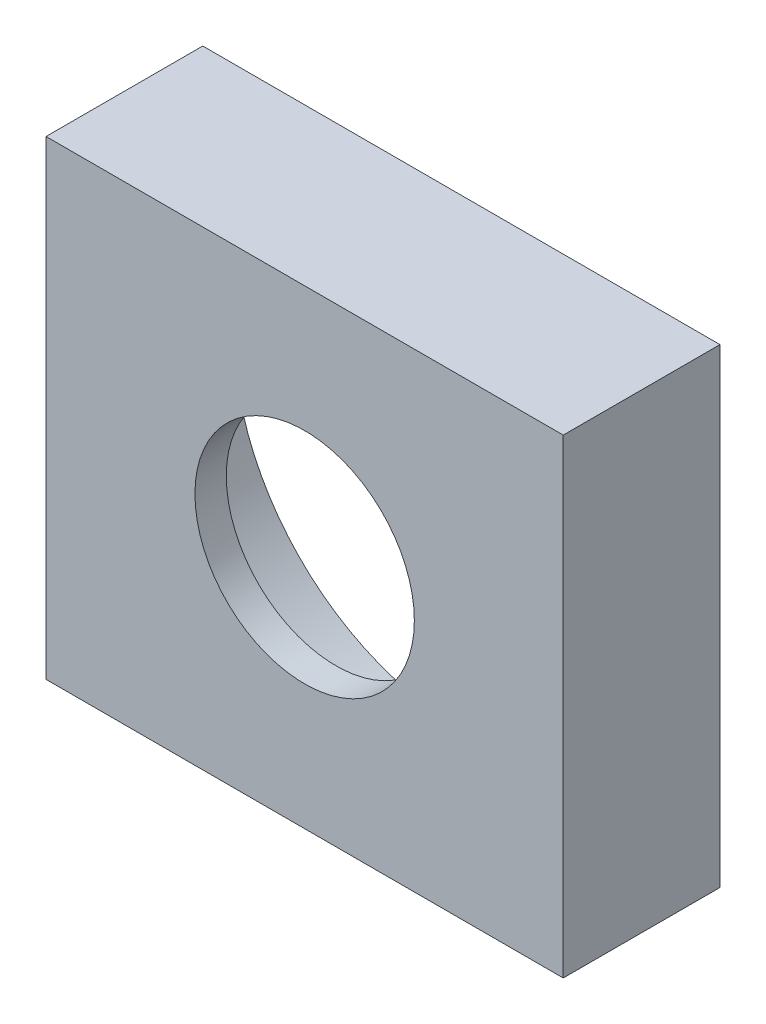
ISO-10303-21;
HEADER;
FILE_DESCRIPTION(('STEP AP214'),'2;1');
FILE_NAME('part.step','',(''),(''),'','','');
FILE_SCHEMA(('AUTOMOTIVE_DESIGN { 1 0 10303 214 1 1 1 1 }'));
ENDSEC;
DATA;
#1=APPLICATION_CONTEXT('core data for automotive mechanical design processes');
#2=APPLICATION_PROTOCOL_DEFINITION('international standard','automotive_design',2000,#1);
#3=PRODUCT_CONTEXT('',#1,'mechanical');
#4=PRODUCT('Part','Part','',(#3));
#5=PRODUCT_RELATED_PRODUCT_CATEGORY('part','',(#4));
#6=PRODUCT_DEFINITION_FORMATION('','',#4);
#7=PRODUCT_DEFINITION_CONTEXT('part definition',#1,'design');
#8=PRODUCT_DEFINITION('design','',#6,#7);
#9=PRODUCT_DEFINITION_SHAPE('','',#8);
#10=(LENGTH_UNIT() NAMED_UNIT(*) SI_UNIT(.MILLI.,.METRE.));
#11=(NAMED_UNIT(*) PLANE_ANGLE_UNIT() SI_UNIT($,.RADIAN.));
#12=(NAMED_UNIT(*) SI_UNIT($,.STERADIAN.) SOLID_ANGLE_UNIT());
#13=UNCERTAINTY_MEASURE_WITH_UNIT(LENGTH_MEASURE(1.E-05),#10,'distance_accuracy_value','');
#14=(GEOMETRIC_REPRESENTATION_CONTEXT(3) GLOBAL_UNCERTAINTY_ASSIGNED_CONTEXT((#13)) GLOBAL_UNIT_ASSIGNED_CONTEXT((#10,
#11,#12)) REPRESENTATION_CONTEXT('',''));
#15=CARTESIAN_POINT('',(0.,0.,0.));
#16=DIRECTION('',(0.,0.,1.));
#17=DIRECTION('',(1.,0.,0.));
#18=AXIS2_PLACEMENT_3D('',#15,#16,#17);
#19=CARTESIAN_POINT('',(16.5,15.,-0.000999999999999265));
#20=DIRECTION('',(0.,0.,1.));
#21=DIRECTION('',(1.,0.,0.));
#22=AXIS2_PLACEMENT_3D('',#19,#20,#21);
#23=CYLINDRICAL_SURFACE('',#22,7.);
#24=CARTESIAN_POINT('',(16.5,15.,10.));
#25=DIRECTION('',(0.,0.,1.));
#26=DIRECTION('',(1.,0.,0.));
#27=AXIS2_PLACEMENT_3D('',#24,#25,#26);
#28=CIRCLE('',#27,7.);
#29=CARTESIAN_POINT('',(23.5,15.,10.));
#30=VERTEX_POINT('',#29);
#31=EDGE_CURVE('E187',#30,#30,#28,.T.);
#32=ORIENTED_EDGE('',*,*,#31,.T.);
#33=EDGE_LOOP('',(#32));
#34=FACE_BOUND('',#33,.T.);
#35=CARTESIAN_POINT('',(16.5,15.,8.));
#36=DIRECTION('',(0.,0.,-1.));
#37=DIRECTION('',(-1.,0.,0.));
#38=AXIS2_PLACEMENT_3D('',#35,#36,#37);
#39=CIRCLE('',#38,7.);
#40=CARTESIAN_POINT('',(9.5,15.,8.));
#41=VERTEX_POINT('',#40);
#42=EDGE_CURVE('E184',#41,#41,#39,.F.);
#43=ORIENTED_EDGE('',*,*,#42,.F.);
#44=EDGE_LOOP('',(#43));
#45=FACE_BOUND('',#44,.T.);
#46=ADVANCED_FACE('F35',(#34,#45),#23,.F.);
#47=CARTESIAN_POINT('',(0.,0.,10.));
#48=DIRECTION('',(1.,0.,0.));
#49=DIRECTION('',(0.,0.,-1.));
#50=AXIS2_PLACEMENT_3D('',#47,#48,#49);
#51=PLANE('',#50);
#52=DIRECTION('',(0.,-1.,0.));
#53=VECTOR('',#52,1.);
#54=CARTESIAN_POINT('',(0.,0.,0.));
#55=LINE('',#54,#53);
#56=CARTESIAN_POINT('',(0.,30.,0.));
#57=VERTEX_POINT('',#56);
#58=CARTESIAN_POINT('',(0.,0.,0.));
#59=VERTEX_POINT('',#58);
#60=EDGE_CURVE('E163',#57,#59,#55,.T.);
#61=ORIENTED_EDGE('',*,*,#60,.T.);
#62=DIRECTION('',(0.,0.,-1.));
#63=VECTOR('',#62,1.);
#64=CARTESIAN_POINT('',(0.,0.,10.));
#65=LINE('',#64,#63);
#66=CARTESIAN_POINT('',(0.,0.,10.));
#67=VERTEX_POINT('',#66);
#68=EDGE_CURVE('E157',#67,#59,#65,.T.);
#69=ORIENTED_EDGE('',*,*,#68,.F.);
#70=DIRECTION('',(0.,-1.,0.));
#71=VECTOR('',#70,1.);
#72=CARTESIAN_POINT('',(0.,0.,10.));
#73=LINE('',#72,#71);
#74=CARTESIAN_POINT('',(0.,30.,10.));
#75=VERTEX_POINT('',#74);
#76=EDGE_CURVE('E173',#75,#67,#73,.T.);
#77=ORIENTED_EDGE('',*,*,#76,.F.);
#78=DIRECTION('',(0.,0.,-1.));
#79=VECTOR('',#78,1.);
#80=CARTESIAN_POINT('',(0.,30.,10.));
#81=LINE('',#80,#79);
#82=EDGE_CURVE('E177',#75,#57,#81,.T.);
#83=ORIENTED_EDGE('',*,*,#82,.T.);
#84=EDGE_LOOP('',(#61,#69,#77,#83));
#85=FACE_BOUND('',#84,.T.);
#86=ADVANCED_FACE('F37',(#85),#51,.F.);
#87=CARTESIAN_POINT('',(0.,0.,10.));
#88=DIRECTION('',(0.,1.,0.));
#89=DIRECTION('',(0.,0.,1.));
#90=AXIS2_PLACEMENT_3D('',#87,#88,#89);
#91=PLANE('',#90);
#92=CARTESIAN_POINT('',(3.,0.,6.));
#93=DIRECTION('',(0.,-1.,0.));
#94=DIRECTION('',(0.,0.,-1.));
#95=AXIS2_PLACEMENT_3D('',#92,#93,#94);
#96=CIRCLE('',#95,1.25);
#97=CARTESIAN_POINT('',(3.,0.,4.75));
#98=VERTEX_POINT('',#97);
#99=EDGE_CURVE('E145',#98,#98,#96,.T.);
#100=ORIENTED_EDGE('',*,*,#99,.F.);
#101=EDGE_LOOP('',(#100));
#102=FACE_BOUND('',#101,.T.);
#103=CARTESIAN_POINT('',(30.,0.,6.));
#104=DIRECTION('',(0.,-1.,0.));
#105=DIRECTION('',(0.,0.,-1.));
#106=AXIS2_PLACEMENT_3D('',#103,#104,#105);
#107=CIRCLE('',#106,1.25);
#108=CARTESIAN_POINT('',(30.,0.,4.75));
#109=VERTEX_POINT('',#108);
#110=EDGE_CURVE('E149',#109,#109,#107,.T.);
#111=ORIENTED_EDGE('',*,*,#110,.F.);
#112=EDGE_LOOP('',(#111));
#113=FACE_BOUND('',#112,.T.);
#114=DIRECTION('',(1.,0.,0.));
#115=VECTOR('',#114,1.);
#116=CARTESIAN_POINT('',(0.,0.,0.));
#117=LINE('',#116,#115);
#118=CARTESIAN_POINT('',(33.,0.,0.));
#119=VERTEX_POINT('',#118);
#120=EDGE_CURVE('E152',#59,#119,#117,.T.);
#121=ORIENTED_EDGE('',*,*,#120,.T.);
#122=DIRECTION('',(0.,0.,-1.));
#123=VECTOR('',#122,1.);
#124=CARTESIAN_POINT('',(33.,0.,10.));
#125=LINE('',#124,#123);
#126=CARTESIAN_POINT('',(33.,0.,10.));
#127=VERTEX_POINT('',#126);
#128=EDGE_CURVE('E154',#127,#119,#125,.T.);
#129=ORIENTED_EDGE('',*,*,#128,.F.);
#130=DIRECTION('',(1.,0.,0.));
#131=VECTOR('',#130,1.);
#132=CARTESIAN_POINT('',(0.,0.,10.));
#133=LINE('',#132,#131);
#134=EDGE_CURVE('E226',#67,#127,#133,.T.);
#135=ORIENTED_EDGE('',*,*,#134,.F.);
#136=ORIENTED_EDGE('',*,*,#68,.T.);
#137=EDGE_LOOP('',(#121,#129,#135,#136));
#138=FACE_BOUND('',#137,.T.);
#139=ADVANCED_FACE('F114',(#102,#113,#138),#91,.F.);
#140=CARTESIAN_POINT('',(33.,0.,10.));
#141=DIRECTION('',(-1.,0.,0.));
#142=DIRECTION('',(0.,0.,1.));
#143=AXIS2_PLACEMENT_3D('',#140,#141,#142);
#144=PLANE('',#143);
#145=DIRECTION('',(0.,1.,0.));
#146=VECTOR('',#145,1.);
#147=CARTESIAN_POINT('',(33.,0.,0.));
#148=LINE('',#147,#146);
#149=CARTESIAN_POINT('',(33.,30.,0.));
#150=VERTEX_POINT('',#149);
#151=EDGE_CURVE('E162',#119,#150,#148,.T.);
#152=ORIENTED_EDGE('',*,*,#151,.T.);
#153=DIRECTION('',(0.,0.,-1.));
#154=VECTOR('',#153,1.);
#155=CARTESIAN_POINT('',(33.,30.,10.));
#156=LINE('',#155,#154);
#157=CARTESIAN_POINT('',(33.,30.,10.));
#158=VERTEX_POINT('',#157);
#159=EDGE_CURVE('E168',#158,#150,#156,.T.);
#160=ORIENTED_EDGE('',*,*,#159,.F.);
#161=DIRECTION('',(0.,1.,0.));
#162=VECTOR('',#161,1.);
#163=CARTESIAN_POINT('',(33.,0.,10.));
#164=LINE('',#163,#162);
#165=EDGE_CURVE('E167',#127,#158,#164,.T.);
#166=ORIENTED_EDGE('',*,*,#165,.F.);
#167=ORIENTED_EDGE('',*,*,#128,.T.);
#168=EDGE_LOOP('',(#152,#160,#166,#167));
#169=FACE_BOUND('',#168,.T.);
#170=ADVANCED_FACE('F134',(#169),#144,.F.);
#171=CARTESIAN_POINT('',(0.,30.,10.));
#172=DIRECTION('',(0.,-1.,0.));
#173=DIRECTION('',(0.,0.,-1.));
#174=AXIS2_PLACEMENT_3D('',#171,#172,#173);
#175=PLANE('',#174);
#176=DIRECTION('',(-1.,0.,0.));
#177=VECTOR('',#176,1.);
#178=CARTESIAN_POINT('',(0.,30.,0.));
#179=LINE('',#178,#177);
#180=EDGE_CURVE('E171',#150,#57,#179,.T.);
#181=ORIENTED_EDGE('',*,*,#180,.T.);
#182=ORIENTED_EDGE('',*,*,#82,.F.);
#183=DIRECTION('',(-1.,0.,0.));
#184=VECTOR('',#183,1.);
#185=CARTESIAN_POINT('',(0.,30.,10.));
#186=LINE('',#185,#184);
#187=EDGE_CURVE('E180',#158,#75,#186,.T.);
#188=ORIENTED_EDGE('',*,*,#187,.F.);
#189=ORIENTED_EDGE('',*,*,#159,.T.);
#190=EDGE_LOOP('',(#181,#182,#188,#189));
#191=FACE_BOUND('',#190,.T.);
#192=ADVANCED_FACE('F126',(#191),#175,.F.);
#193=CARTESIAN_POINT('',(0.,30.,10.));
#194=DIRECTION('',(0.,0.,-1.));
#195=DIRECTION('',(-1.,0.,0.));
#196=AXIS2_PLACEMENT_3D('',#193,#194,#195);
#197=PLANE('',#196);
#198=ORIENTED_EDGE('',*,*,#31,.F.);
#199=EDGE_LOOP('',(#198));
#200=FACE_BOUND('',#199,.T.);
#201=ORIENTED_EDGE('',*,*,#76,.T.);
#202=ORIENTED_EDGE('',*,*,#134,.T.);
#203=ORIENTED_EDGE('',*,*,#165,.T.);
#204=ORIENTED_EDGE('',*,*,#187,.T.);
#205=EDGE_LOOP('',(#201,#202,#203,#204));
#206=FACE_BOUND('',#205,.T.);
#207=ADVANCED_FACE('F122',(#200,#206),#197,.F.);
#208=CARTESIAN_POINT('',(0.,30.,0.));
#209=DIRECTION('',(0.,0.,-1.));
#210=DIRECTION('',(-1.,0.,0.));
#211=AXIS2_PLACEMENT_3D('',#208,#209,#210);
#212=PLANE('',#211);
#213=CARTESIAN_POINT('',(16.5,15.,0.));
#214=DIRECTION('',(0.,0.,-1.));
#215=DIRECTION('',(-1.,0.,0.));
#216=AXIS2_PLACEMENT_3D('',#213,#214,#215);
#217=CIRCLE('',#216,14.5);
#218=CARTESIAN_POINT('',(2.,15.,0.));
#219=VERTEX_POINT('',#218);
#220=EDGE_CURVE('E217',#219,#219,#217,.T.);
#221=ORIENTED_EDGE('',*,*,#220,.F.);
#222=EDGE_LOOP('',(#221));
#223=FACE_BOUND('',#222,.T.);
#224=ORIENTED_EDGE('',*,*,#60,.F.);
#225=ORIENTED_EDGE('',*,*,#180,.F.);
#226=ORIENTED_EDGE('',*,*,#151,.F.);
#227=ORIENTED_EDGE('',*,*,#120,.F.);
#228=EDGE_LOOP('',(#224,#225,#226,#227));
#229=FACE_BOUND('',#228,.T.);
#230=ADVANCED_FACE('F125',(#223,#229),#212,.T.);
#231=CARTESIAN_POINT('',(0.,30.,8.));
#232=DIRECTION('',(0.,0.,-1.));
#233=DIRECTION('',(-1.,0.,0.));
#234=AXIS2_PLACEMENT_3D('',#231,#232,#233);
#235=PLANE('',#234);
#236=CARTESIAN_POINT('',(16.5,15.,8.));
#237=DIRECTION('',(0.,0.,-1.));
#238=DIRECTION('',(-1.,0.,0.));
#239=AXIS2_PLACEMENT_3D('',#236,#237,#238);
#240=CIRCLE('',#239,14.5);
#241=CARTESIAN_POINT('',(2.,15.,8.));
#242=VERTEX_POINT('',#241);
#243=EDGE_CURVE('E188',#242,#242,#240,.F.);
#244=ORIENTED_EDGE('',*,*,#243,.F.);
#245=EDGE_LOOP('',(#244));
#246=FACE_BOUND('',#245,.T.);
#247=ORIENTED_EDGE('',*,*,#42,.T.);
#248=EDGE_LOOP('',(#247));
#249=FACE_BOUND('',#248,.T.);
#250=ADVANCED_FACE('F130',(#246,#249),#235,.T.);
#251=CARTESIAN_POINT('',(16.5,15.,51.0121933088198));
#252=DIRECTION('',(0.,0.,-1.));
#253=DIRECTION('',(-1.,0.,0.));
#254=AXIS2_PLACEMENT_3D('',#251,#252,#253);
#255=CYLINDRICAL_SURFACE('',#254,14.5);
#256=CARTESIAN_POINT('',(3.84338028202273,7.92469242262155,7.08639319051788));
#257=CARTESIAN_POINT('',(3.83054852448721,7.94764548966309,7.04797604075574));
#258=CARTESIAN_POINT('',(3.81785626415476,7.97049749274034,7.00944981527298));
#259=CARTESIAN_POINT('',(3.79280012953271,8.01589372018508,6.93208130404045));
#260=CARTESIAN_POINT('',(3.78043643137844,8.03843777644262,6.89323886278883));
#261=CARTESIAN_POINT('',(3.75572263565132,8.08378121953114,6.8139684768469));
#262=CARTESIAN_POINT('',(3.74338487827952,8.10656680248024,6.77352874828641));
#263=CARTESIAN_POINT('',(3.7192379336437,8.1514403883418,6.69212302936347));
#264=CARTESIAN_POINT('',(3.70742857419097,8.17352861779939,6.65115721611961));
#265=CARTESIAN_POINT('',(3.68629928153835,8.21328508733713,6.57486909963253));
#266=CARTESIAN_POINT('',(3.67687721312523,8.23110774363595,6.53965629211058));
#267=CARTESIAN_POINT('',(3.65874430933315,8.26557128045907,6.46848069271335));
#268=CARTESIAN_POINT('',(3.65003328955378,8.28221246723406,6.43251809834139));
#269=CARTESIAN_POINT('',(3.63375891473335,8.31343537925393,6.35993345680229));
#270=CARTESIAN_POINT('',(3.62618370529157,8.32803824813577,6.32332345057256));
#271=CARTESIAN_POINT('',(3.61265808236997,8.35420189638158,6.24877767513898));
#272=CARTESIAN_POINT('',(3.6067046722431,8.3657682848851,6.21084449918214));
#273=CARTESIAN_POINT('',(3.59697794977275,8.38470296490904,6.12998933220697));
#274=CARTESIAN_POINT('',(3.59343659842143,8.39162382313634,6.08691906897249));
#275=CARTESIAN_POINT('',(3.59131285222776,8.3957743747049,6.02192592877541));
#276=CARTESIAN_POINT('',(3.59113340737958,8.39612512189677,6.00024233691712));
#277=CARTESIAN_POINT('',(3.59182882726146,8.39476586072555,5.95695424794979));
#278=CARTESIAN_POINT('',(3.59270393351586,8.3930553802785,5.93534977009713));
#279=CARTESIAN_POINT('',(3.59736260366101,8.38395885333876,5.8620015956364));
#280=CARTESIAN_POINT('',(3.60351098404195,8.37196373169522,5.81097725604358));
#281=CARTESIAN_POINT('',(3.61535339593347,8.3489882161212,5.73608751128985));
#282=CARTESIAN_POINT('',(3.61979984976516,8.340379033297,5.71114052677213));
#283=CARTESIAN_POINT('',(3.62934273969339,8.32195465561161,5.66181506452925));
#284=CARTESIAN_POINT('',(3.63443899026137,8.31213980501921,5.63743642687184));
#285=CARTESIAN_POINT('',(3.64689810277356,8.28821867705315,5.5810771047081));
#286=CARTESIAN_POINT('',(3.65444849140172,8.27377596748074,5.54928457266308));
#287=CARTESIAN_POINT('',(3.67014696772337,8.24387996071648,5.48632442080051));
#288=CARTESIAN_POINT('',(3.67829520734268,8.22842640675799,5.4551569624067));
#289=CARTESIAN_POINT('',(3.70341220567866,8.18101072125994,5.36226770806473));
#290=CARTESIAN_POINT('',(3.72103298537507,8.14803258175757,5.30124512723273));
#291=CARTESIAN_POINT('',(3.75581235330913,8.08357660916074,5.18541213359474));
#292=CARTESIAN_POINT('',(3.77288386026302,8.05220798999103,5.13051303069147));
#293=CARTESIAN_POINT('',(3.80767893738036,7.98884461948747,5.02154907788305));
#294=CARTESIAN_POINT('',(3.82540012703176,7.956852322658,4.96748204658996));
#295=CARTESIAN_POINT('',(3.84338028202272,7.92469242262156,4.91360680948212));
#296=B_SPLINE_CURVE_WITH_KNOTS('',3,(#256,#257,#258,#259,#260,#261,#262,#263,#264,#265,#266,
#267,#268,#269,#270,#271,#272,#273,#274,#275,#276,#277,#278,#279,#280,#281,#282,#283,#284,#285,
#286,#287,#288,#289,#290,#291,#292,#293,#294,#295),.UNSPECIFIED.,.F.,.F.,(4,2,2,2,2,2,2,2,2,2,2,
2,2,2,2,2,2,2,2,4),(0.,0.139667383751182,0.279408188661051,0.423487593363858,0.567519699867175,
0.689226092807145,0.810900821968498,0.931200869922507,1.05127710449946,1.18169642398604,
1.24663701550914,1.31159248323445,1.46868844151039,1.54897726791781,1.62924322155191,
1.7363885732595,1.8435612476672,2.05819616230277,2.25466717575665,2.4504788540057),.UNSPECIFIED.);
#297=CARTESIAN_POINT('',(3.80157490079971,8.,6.95915466865774));
#298=VERTEX_POINT('',#297);
#299=CARTESIAN_POINT('',(3.8015749007997,8.00000000000001,5.04084533134226));
#300=VERTEX_POINT('',#299);
#301=EDGE_CURVE('E48',#298,#300,#296,.T.);
#302=ORIENTED_EDGE('',*,*,#301,.T.);
#303=CARTESIAN_POINT('',(3.80157490079971,8.,5.04084533134226));
#304=CARTESIAN_POINT('',(3.82498258849649,7.95753056734226,5.06043005190936));
#305=CARTESIAN_POINT('',(3.84835914478156,7.91563438563505,5.08140227389511));
#306=CARTESIAN_POINT('',(3.89486685365084,7.83321243755819,5.12662583743854));
#307=CARTESIAN_POINT('',(3.91799643750514,7.79269365207694,5.15089144951295));
#308=CARTESIAN_POINT('',(3.963970583821,7.71301713014952,5.20344748588492));
#309=CARTESIAN_POINT('',(3.98680495439896,7.67389079088138,5.23179516957541));
#310=CARTESIAN_POINT('',(4.03130234453035,7.59841294994478,5.29265647951779));
#311=CARTESIAN_POINT('',(4.05296759641542,7.56205610124394,5.32516173587104));
#312=CARTESIAN_POINT('',(4.09345510122229,7.49472806269466,5.39309179953345));
#313=CARTESIAN_POINT('',(4.11236613598367,7.46357639592328,5.42828177053834));
#314=CARTESIAN_POINT('',(4.14775314564638,7.40571634858923,5.50313933496227));
#315=CARTESIAN_POINT('',(4.16423563619089,7.37899605376722,5.54279442443674));
#316=CARTESIAN_POINT('',(4.19399416531521,7.33103463003824,5.62729442969863));
#317=CARTESIAN_POINT('',(4.20722212369373,7.30987537754228,5.67220418538974));
#318=CARTESIAN_POINT('',(4.22884926878699,7.27541050127003,5.76605189556674));
#319=CARTESIAN_POINT('',(4.23725676714123,7.26209135818434,5.81498274908478));
#320=CARTESIAN_POINT('',(4.24746678834016,7.24593581892914,5.90899806511692));
#321=CARTESIAN_POINT('',(4.24995240203609,7.24201492415173,5.95381917964441));
#322=CARTESIAN_POINT('',(4.25004613810521,7.24186673181438,6.04347869117644));
#323=CARTESIAN_POINT('',(4.24765573207124,7.24563711301145,6.08831707888456));
#324=CARTESIAN_POINT('',(4.23902210960931,7.25929784104523,6.16951254312718));
#325=CARTESIAN_POINT('',(4.23342211239383,7.26816709118201,6.20612016324491));
#326=CARTESIAN_POINT('',(4.21938971794372,7.2904743881443,6.27731972469488));
#327=CARTESIAN_POINT('',(4.21095689822548,7.30391311645974,6.31191136446278));
#328=CARTESIAN_POINT('',(4.18737590749554,7.34167270106916,6.39395948683517));
#329=CARTESIAN_POINT('',(4.17092156414138,7.36815782267224,6.44004164332797));
#330=CARTESIAN_POINT('',(4.13460018421179,7.42714737826643,6.52668971755868));
#331=CARTESIAN_POINT('',(4.11472403394374,7.45966790557466,6.56724037190857));
#332=CARTESIAN_POINT('',(4.06046997050648,7.54935010545019,6.66531159282127));
#333=CARTESIAN_POINT('',(4.0244140699409,7.60979225882233,6.7188701789887));
#334=CARTESIAN_POINT('',(3.94974059612741,7.73732183231046,6.81498553814466));
#335=CARTESIAN_POINT('',(3.91111883473112,7.80442020972672,6.85752373967457));
#336=CARTESIAN_POINT('',(3.86034920141143,7.89438243978977,6.90695233652836));
#337=CARTESIAN_POINT('',(3.84860486962869,7.91531316448723,6.91794329407473));
#338=CARTESIAN_POINT('',(3.82510433328925,7.95744384578166,6.93912361420949));
#339=CARTESIAN_POINT('',(3.81334834989857,7.97864244980856,6.94931590964779));
#340=CARTESIAN_POINT('',(3.80157490079989,7.99999999999952,6.95915466865879));
#341=B_SPLINE_CURVE_WITH_KNOTS('',3,(#303,#304,#305,#306,#307,#308,#309,#310,#311,#312,#313,
#314,#315,#316,#317,#318,#319,#320,#321,#322,#323,#324,#325,#326,#327,#328,#329,#330,#331,#332,
#333,#334,#335,#336,#337,#338,#339,#340),.UNSPECIFIED.,.F.,.F.,(4,2,2,2,2,2,2,2,2,2,2,2,2,2,2,2,
2,2,4),(0.,0.156934113768938,0.31457134221811,0.474685942839683,0.63448313488642,
0.786095009978283,0.937292407796687,1.09060489163471,1.24365222646864,1.3779463336928,
1.51219991667429,1.62597766740962,1.73977239435602,1.9057475807387,2.07217186754267,
2.33601948685052,2.60030888942556,2.67949425265581,2.7583736892264),.UNSPECIFIED.);
#342=EDGE_CURVE('E12',#300,#298,#341,.T.);
#343=ORIENTED_EDGE('',*,*,#342,.T.);
#344=EDGE_LOOP('',(#302,#343));
#345=FACE_BOUND('',#344,.T.);
#346=CARTESIAN_POINT('',(29.1984250992003,8.,6.95915466865774));
#347=CARTESIAN_POINT('',(29.1750174115035,7.95753056734226,6.93956994809063));
#348=CARTESIAN_POINT('',(29.1516408552184,7.91563438563505,6.91859772610488));
#349=CARTESIAN_POINT('',(29.1051331463492,7.83321243755819,6.87337416256146));
#350=CARTESIAN_POINT('',(29.0820035624949,7.79269365207694,6.84910855048706));
#351=CARTESIAN_POINT('',(29.036029416179,7.71301713014952,6.79655251411508));
#352=CARTESIAN_POINT('',(29.013195045601,7.67389079088138,6.76820483042459));
#353=CARTESIAN_POINT('',(28.9686976554697,7.59841294994479,6.70734352048221));
#354=CARTESIAN_POINT('',(28.9470324035846,7.56205610124394,6.67483826412895));
#355=CARTESIAN_POINT('',(28.9065448987777,7.49472806269466,6.60690820046655));
#356=CARTESIAN_POINT('',(28.8876338640163,7.46357639592328,6.57171822946166));
#357=CARTESIAN_POINT('',(28.8522468543536,7.40571634858923,6.49686066503773));
#358=CARTESIAN_POINT('',(28.8357643638091,7.37899605376722,6.45720557556326));
#359=CARTESIAN_POINT('',(28.8060058346848,7.33103463003824,6.37270557030137));
#360=CARTESIAN_POINT('',(28.7927778763063,7.30987537754228,6.32779581461026));
#361=CARTESIAN_POINT('',(28.771150731213,7.27541050127004,6.23394810443326));
#362=CARTESIAN_POINT('',(28.7627432328588,7.26209135818435,6.18501725091522));
#363=CARTESIAN_POINT('',(28.7525332116598,7.24593581892914,6.09100193488308));
#364=CARTESIAN_POINT('',(28.7500475979639,7.24201492415173,6.04618082035559));
#365=CARTESIAN_POINT('',(28.7499538618948,7.24186673181438,5.95652130882356));
#366=CARTESIAN_POINT('',(28.7523442679288,7.24563711301145,5.91168292111544));
#367=CARTESIAN_POINT('',(28.7609778903907,7.25929784104523,5.83048745687282));
#368=CARTESIAN_POINT('',(28.7665778876062,7.26816709118201,5.7938798367551));
#369=CARTESIAN_POINT('',(28.7806102820563,7.2904743881443,5.72268027530512));
#370=CARTESIAN_POINT('',(28.7890431017745,7.30391311645974,5.68808863553722));
#371=CARTESIAN_POINT('',(28.8126240925045,7.34167270106917,5.60604051316483));
#372=CARTESIAN_POINT('',(28.8290784358586,7.36815782267224,5.55995835667203));
#373=CARTESIAN_POINT('',(28.8653998157882,7.42714737826644,5.47331028244132));
#374=CARTESIAN_POINT('',(28.8852759660563,7.45966790557466,5.43275962809143));
#375=CARTESIAN_POINT('',(28.9395300294935,7.54935010545019,5.33468840717874));
#376=CARTESIAN_POINT('',(28.9755859300591,7.60979225882233,5.2811298210113));
#377=CARTESIAN_POINT('',(29.0502594038726,7.73732183231045,5.18501446185534));
#378=CARTESIAN_POINT('',(29.0888811652689,7.80442020972672,5.14247626032543));
#379=CARTESIAN_POINT('',(29.1396507985886,7.89438243978977,5.09304766347165));
#380=CARTESIAN_POINT('',(29.1513951303713,7.91531316448723,5.08205670592527));
#381=CARTESIAN_POINT('',(29.1748956667107,7.95744384578166,5.06087638579051));
#382=CARTESIAN_POINT('',(29.1866516501014,7.97864244980856,5.05068409035221));
#383=CARTESIAN_POINT('',(29.1984250992001,7.99999999999952,5.04084533134121));
#384=B_SPLINE_CURVE_WITH_KNOTS('',3,(#346,#347,#348,#349,#350,#351,#352,#353,#354,#355,#356,
#357,#358,#359,#360,#361,#362,#363,#364,#365,#366,#367,#368,#369,#370,#371,#372,#373,#374,#375,
#376,#377,#378,#379,#380,#381,#382,#383),.UNSPECIFIED.,.F.,.F.,(4,2,2,2,2,2,2,2,2,2,2,2,2,2,2,2,
2,2,4),(0.,0.156934113768935,0.314571342218107,0.47468594283968,0.634483134886418,
0.786095009978279,0.937292407796684,1.0906048916347,1.24365222646864,1.3779463336928,
1.51219991667429,1.62597766740962,1.73977239435602,1.90574758073869,2.07217186754266,
2.33601948685051,2.60030888942554,2.6794942526558,2.75837368922639),.UNSPECIFIED.);
#385=CARTESIAN_POINT('',(29.1984250992003,8.,6.95915466865774));
#386=VERTEX_POINT('',#385);
#387=CARTESIAN_POINT('',(29.1984250992003,8.,5.04084533134226));
#388=VERTEX_POINT('',#387);
#389=EDGE_CURVE('E183',#386,#388,#384,.T.);
#390=ORIENTED_EDGE('',*,*,#389,.T.);
#391=CARTESIAN_POINT('',(29.1566197179773,7.92469242262155,4.91360680948213));
#392=CARTESIAN_POINT('',(29.1694514755128,7.94764548966309,4.95202395924426));
#393=CARTESIAN_POINT('',(29.1821437358452,7.97049749274034,4.99055018472702));
#394=CARTESIAN_POINT('',(29.2071998704673,8.01589372018508,5.06791869595955));
#395=CARTESIAN_POINT('',(29.2195635686216,8.03843777644262,5.10676113721117));
#396=CARTESIAN_POINT('',(29.2442773643487,8.08378121953114,5.1860315231531));
#397=CARTESIAN_POINT('',(29.2566151217205,8.10656680248024,5.22647125171359));
#398=CARTESIAN_POINT('',(29.2807620663563,8.1514403883418,5.30787697063653));
#399=CARTESIAN_POINT('',(29.292571425809,8.17352861779939,5.34884278388039));
#400=CARTESIAN_POINT('',(29.3137007184617,8.21328508733713,5.42513090036747));
#401=CARTESIAN_POINT('',(29.3231227868748,8.23110774363595,5.46034370788943));
#402=CARTESIAN_POINT('',(29.3412556906669,8.26557128045907,5.53151930728665));
#403=CARTESIAN_POINT('',(29.3499667104462,8.28221246723406,5.56748190165861));
#404=CARTESIAN_POINT('',(29.3662410852666,8.31343537925393,5.64006654319771));
#405=CARTESIAN_POINT('',(29.3738162947084,8.32803824813577,5.67667654942744));
#406=CARTESIAN_POINT('',(29.38734191763,8.35420189638158,5.75122232486102));
#407=CARTESIAN_POINT('',(29.3932953277569,8.3657682848851,5.78915550081787));
#408=CARTESIAN_POINT('',(29.4030220502273,8.38470296490904,5.87001066779304));
#409=CARTESIAN_POINT('',(29.4065634015786,8.39162382313634,5.91308093102751));
#410=CARTESIAN_POINT('',(29.4086871477722,8.3957743747049,5.9780740712246));
#411=CARTESIAN_POINT('',(29.4088665926204,8.39612512189677,5.99975766308288));
#412=CARTESIAN_POINT('',(29.4081711727385,8.39476586072555,6.04304575205022));
#413=CARTESIAN_POINT('',(29.4072960664841,8.3930553802785,6.06465022990288));
#414=CARTESIAN_POINT('',(29.402637396339,8.38395885333876,6.13799840436361));
#415=CARTESIAN_POINT('',(29.3964890159581,8.37196373169522,6.18902274395643));
#416=CARTESIAN_POINT('',(29.3846466040665,8.34898821612119,6.26391248871016));
#417=CARTESIAN_POINT('',(29.3802001502348,8.340379033297,6.28885947322788));
#418=CARTESIAN_POINT('',(29.3706572603066,8.32195465561161,6.33818493547076));
#419=CARTESIAN_POINT('',(29.3655610097386,8.31213980501921,6.36256357312817));
#420=CARTESIAN_POINT('',(29.3531018972264,8.28821867705314,6.41892289529191));
#421=CARTESIAN_POINT('',(29.3455515085983,8.27377596748073,6.45071542733693));
#422=CARTESIAN_POINT('',(29.3298530322766,8.24387996071648,6.51367557919949));
#423=CARTESIAN_POINT('',(29.3217047926573,8.22842640675798,6.54484303759331));
#424=CARTESIAN_POINT('',(29.2965877943213,8.18101072125994,6.63773229193528));
#425=CARTESIAN_POINT('',(29.2789670146249,8.14803258175757,6.69875487276727));
#426=CARTESIAN_POINT('',(29.2441876466909,8.08357660916074,6.81458786640526));
#427=CARTESIAN_POINT('',(29.227116139737,8.05220798999103,6.86948696930853));
#428=CARTESIAN_POINT('',(29.1923210626196,7.98884461948747,6.97845092211694));
#429=CARTESIAN_POINT('',(29.1745998729682,7.956852322658,7.03251795341003));
#430=CARTESIAN_POINT('',(29.1566197179773,7.92469242262156,7.08639319051788));
#431=B_SPLINE_CURVE_WITH_KNOTS('',3,(#391,#392,#393,#394,#395,#396,#397,#398,#399,#400,#401,
#402,#403,#404,#405,#406,#407,#408,#409,#410,#411,#412,#413,#414,#415,#416,#417,#418,#419,#420,
#421,#422,#423,#424,#425,#426,#427,#428,#429,#430),.UNSPECIFIED.,.F.,.F.,(4,2,2,2,2,2,2,2,2,2,2,
2,2,2,2,2,2,2,2,4),(0.,0.139667383751181,0.27940818866105,0.423487593363858,0.567519699867174,
0.689226092807145,0.8109008219685,0.931200869922509,1.05127710449947,1.18169642398605,
1.24663701550915,1.31159248323446,1.4686884415104,1.54897726791782,1.62924322155192,
1.73638857325951,1.8435612476672,2.05819616230277,2.25466717575665,2.45047885400569),.UNSPECIFIED.);
#432=EDGE_CURVE('E194',#388,#386,#431,.T.);
#433=ORIENTED_EDGE('',*,*,#432,.T.);
#434=EDGE_LOOP('',(#390,#433));
#435=FACE_BOUND('',#434,.T.);
#436=ORIENTED_EDGE('',*,*,#243,.T.);
#437=EDGE_LOOP('',(#436));
#438=FACE_BOUND('',#437,.T.);
#439=ORIENTED_EDGE('',*,*,#220,.T.);
#440=EDGE_LOOP('',(#439));
#441=FACE_BOUND('',#440,.T.);
#442=ADVANCED_FACE('F119',(#345,#435,#438,#441),#255,.F.);
#443=CARTESIAN_POINT('',(30.,8.,6.));
#444=DIRECTION('',(0.,-1.,0.));
#445=DIRECTION('',(0.,0.,-1.));
#446=AXIS2_PLACEMENT_3D('',#443,#444,#445);
#447=CONICAL_SURFACE('',#446,1.25,1.02974425867665);
#448=CARTESIAN_POINT('',(30.,8.75107577378445,6.));
#449=VERTEX_POINT('',#448);
#450=VERTEX_LOOP('',#449);
#451=FACE_BOUND('',#450,.T.);
#452=CARTESIAN_POINT('',(30.,8.,6.));
#453=DIRECTION('',(0.,-1.,0.));
#454=DIRECTION('',(0.,0.,-1.));
#455=AXIS2_PLACEMENT_3D('',#452,#453,#454);
#456=CIRCLE('',#455,1.25);
#457=EDGE_CURVE('E61',#388,#386,#456,.T.);
#458=ORIENTED_EDGE('',*,*,#457,.T.);
#459=ORIENTED_EDGE('',*,*,#432,.F.);
#460=EDGE_LOOP('',(#458,#459));
#461=FACE_BOUND('',#460,.T.);
#462=ADVANCED_FACE('F201',(#451,#461),#447,.F.);
#463=CARTESIAN_POINT('',(30.,0.,6.));
#464=DIRECTION('',(0.,-1.,0.));
#465=DIRECTION('',(0.,0.,-1.));
#466=AXIS2_PLACEMENT_3D('',#463,#464,#465);
#467=CYLINDRICAL_SURFACE('',#466,1.25);
#468=ORIENTED_EDGE('',*,*,#110,.T.);
#469=EDGE_LOOP('',(#468));
#470=FACE_BOUND('',#469,.T.);
#471=ORIENTED_EDGE('',*,*,#457,.F.);
#472=ORIENTED_EDGE('',*,*,#389,.F.);
#473=EDGE_LOOP('',(#471,#472));
#474=FACE_BOUND('',#473,.T.);
#475=ADVANCED_FACE('F104',(#470,#474),#467,.F.);
#476=CARTESIAN_POINT('',(3.,0.,6.));
#477=DIRECTION('',(0.,-1.,0.));
#478=DIRECTION('',(0.,0.,-1.));
#479=AXIS2_PLACEMENT_3D('',#476,#477,#478);
#480=CYLINDRICAL_SURFACE('',#479,1.25);
#481=ORIENTED_EDGE('',*,*,#99,.T.);
#482=EDGE_LOOP('',(#481));
#483=FACE_BOUND('',#482,.T.);
#484=CARTESIAN_POINT('',(3.,8.,6.));
#485=DIRECTION('',(0.,-1.,0.));
#486=DIRECTION('',(0.,0.,-1.));
#487=AXIS2_PLACEMENT_3D('',#484,#485,#486);
#488=CIRCLE('',#487,1.25);
#489=EDGE_CURVE('E54',#298,#300,#488,.T.);
#490=ORIENTED_EDGE('',*,*,#489,.F.);
#491=ORIENTED_EDGE('',*,*,#342,.F.);
#492=EDGE_LOOP('',(#490,#491));
#493=FACE_BOUND('',#492,.T.);
#494=ADVANCED_FACE('F99',(#483,#493),#480,.F.);
#495=CARTESIAN_POINT('',(3.,8.,6.));
#496=DIRECTION('',(0.,-1.,0.));
#497=DIRECTION('',(0.,0.,-1.));
#498=AXIS2_PLACEMENT_3D('',#495,#496,#497);
#499=CONICAL_SURFACE('',#498,1.25,1.02974425867665);
#500=CARTESIAN_POINT('',(3.,8.75107577378445,6.));
#501=VERTEX_POINT('',#500);
#502=VERTEX_LOOP('',#501);
#503=FACE_BOUND('',#502,.T.);
#504=ORIENTED_EDGE('',*,*,#489,.T.);
#505=ORIENTED_EDGE('',*,*,#301,.F.);
#506=EDGE_LOOP('',(#504,#505));
#507=FACE_BOUND('',#506,.T.);
#508=ADVANCED_FACE('F97',(#503,#507),#499,.F.);
#509=CLOSED_SHELL('',(#46,#86,#139,#170,#192,#207,#230,#250,#442,#462,#475,#494,#508));
#510=MANIFOLD_SOLID_BREP('B2',#509);
#511=ADVANCED_BREP_SHAPE_REPRESENTATION('',(#18,#510),#14);
#512=SHAPE_DEFINITION_REPRESENTATION(#9,#511);
ENDSEC;
END-ISO-10303-21;
